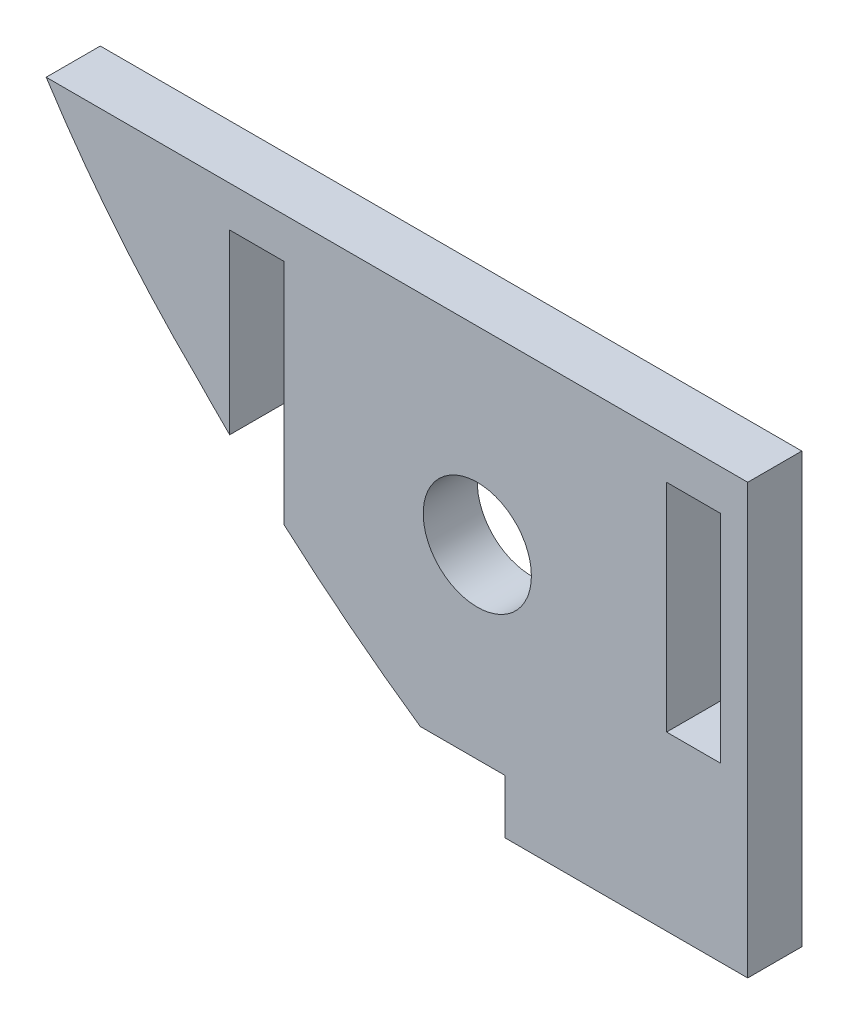
ISO-10303-21;
HEADER;
FILE_DESCRIPTION(('STEP AP214'),'2;1');
FILE_NAME('part.step','',(''),(''),'','','');
FILE_SCHEMA(('AUTOMOTIVE_DESIGN { 1 0 10303 214 1 1 1 1 }'));
ENDSEC;
DATA;
#1=APPLICATION_CONTEXT('core data for automotive mechanical design processes');
#2=APPLICATION_PROTOCOL_DEFINITION('international standard','automotive_design',2000,#1);
#3=PRODUCT_CONTEXT('',#1,'mechanical');
#4=PRODUCT('Part','Part','',(#3));
#5=PRODUCT_RELATED_PRODUCT_CATEGORY('part','',(#4));
#6=PRODUCT_DEFINITION_FORMATION('','',#4);
#7=PRODUCT_DEFINITION_CONTEXT('part definition',#1,'design');
#8=PRODUCT_DEFINITION('design','',#6,#7);
#9=PRODUCT_DEFINITION_SHAPE('','',#8);
#10=(LENGTH_UNIT() NAMED_UNIT(*) SI_UNIT(.MILLI.,.METRE.));
#11=(NAMED_UNIT(*) PLANE_ANGLE_UNIT() SI_UNIT($,.RADIAN.));
#12=(NAMED_UNIT(*) SI_UNIT($,.STERADIAN.) SOLID_ANGLE_UNIT());
#13=UNCERTAINTY_MEASURE_WITH_UNIT(LENGTH_MEASURE(1.E-05),#10,'distance_accuracy_value','');
#14=(GEOMETRIC_REPRESENTATION_CONTEXT(3) GLOBAL_UNCERTAINTY_ASSIGNED_CONTEXT((#13)) GLOBAL_UNIT_ASSIGNED_CONTEXT((#10,
#11,#12)) REPRESENTATION_CONTEXT('',''));
#15=CARTESIAN_POINT('',(0.,0.,0.));
#16=DIRECTION('',(0.,0.,1.));
#17=DIRECTION('',(1.,0.,0.));
#18=AXIS2_PLACEMENT_3D('',#15,#16,#17);
#19=CARTESIAN_POINT('',(8.86495465715672,23.9719209613924,2.));
#20=DIRECTION('',(0.,0.,1.));
#21=DIRECTION('',(1.,0.,0.));
#22=AXIS2_PLACEMENT_3D('',#19,#20,#21);
#23=PLANE('',#22);
#24=DIRECTION('',(0.,-1.,0.));
#25=VECTOR('',#24,1.);
#26=CARTESIAN_POINT('',(-0.675492065806116,-6.33042368116616,2.));
#27=LINE('',#26,#25);
#28=CARTESIAN_POINT('',(-0.675492065806116,1.66957631883384,2.));
#29=VERTEX_POINT('',#28);
#30=CARTESIAN_POINT('',(-0.675492065806116,-6.33042368116616,2.));
#31=VERTEX_POINT('',#30);
#32=EDGE_CURVE('E147',#29,#31,#27,.T.);
#33=ORIENTED_EDGE('',*,*,#32,.F.);
#34=DIRECTION('',(-1.,0.,0.));
#35=VECTOR('',#34,1.);
#36=CARTESIAN_POINT('',(-0.675492065806116,1.66957631883384,2.));
#37=LINE('',#36,#35);
#38=CARTESIAN_POINT('',(1.32450793419388,1.66957631883384,2.));
#39=VERTEX_POINT('',#38);
#40=EDGE_CURVE('E139',#39,#29,#37,.T.);
#41=ORIENTED_EDGE('',*,*,#40,.F.);
#42=DIRECTION('',(0.,1.,0.));
#43=VECTOR('',#42,1.);
#44=CARTESIAN_POINT('',(1.32450793419388,1.66957631883384,2.));
#45=LINE('',#44,#43);
#46=CARTESIAN_POINT('',(1.32450793419388,-6.33042368116616,2.));
#47=VERTEX_POINT('',#46);
#48=EDGE_CURVE('E162',#47,#39,#45,.T.);
#49=ORIENTED_EDGE('',*,*,#48,.F.);
#50=DIRECTION('',(1.,0.,0.));
#51=VECTOR('',#50,1.);
#52=CARTESIAN_POINT('',(1.32450793419388,-6.33042368116616,2.));
#53=LINE('',#52,#51);
#54=EDGE_CURVE('E160',#31,#47,#53,.T.);
#55=ORIENTED_EDGE('',*,*,#54,.F.);
#56=EDGE_LOOP('',(#33,#41,#49,#55));
#57=FACE_BOUND('',#56,.T.);
#58=DIRECTION('',(1.,0.,0.));
#59=VECTOR('',#58,1.);
#60=CARTESIAN_POINT('',(-6.6541329981665,-12.706050279369,2.));
#61=LINE('',#60,#59);
#62=CARTESIAN_POINT('',(-6.6541329981665,-12.706050279369,2.));
#63=VERTEX_POINT('',#62);
#64=CARTESIAN_POINT('',(2.32450793419389,-12.706050279369,2.));
#65=VERTEX_POINT('',#64);
#66=EDGE_CURVE('E178',#63,#65,#61,.T.);
#67=ORIENTED_EDGE('',*,*,#66,.T.);
#68=DIRECTION('',(0.,1.,0.));
#69=VECTOR('',#68,1.);
#70=CARTESIAN_POINT('',(2.32450793419389,3.16957631883384,2.));
#71=LINE('',#70,#69);
#72=CARTESIAN_POINT('',(2.32450793419389,3.16957631883384,2.));
#73=VERTEX_POINT('',#72);
#74=EDGE_CURVE('E181',#65,#73,#71,.T.);
#75=ORIENTED_EDGE('',*,*,#74,.T.);
#76=DIRECTION('',(-1.,0.,0.));
#77=VECTOR('',#76,1.);
#78=CARTESIAN_POINT('',(-23.6167131458751,3.16957631883382,2.));
#79=LINE('',#78,#77);
#80=CARTESIAN_POINT('',(-23.6167131458751,3.16957631883383,2.));
#81=VERTEX_POINT('',#80);
#82=EDGE_CURVE('E184',#73,#81,#79,.T.);
#83=ORIENTED_EDGE('',*,*,#82,.T.);
#84=CARTESIAN_POINT('',(8.86495465715672,23.9719209613924,2.));
#85=DIRECTION('',(0.,0.,1.));
#86=DIRECTION('',(1.,0.,0.));
#87=AXIS2_PLACEMENT_3D('',#84,#85,#86);
#88=CIRCLE('',#87,38.5719624325014);
#89=CARTESIAN_POINT('',(-17.9999999999967,-3.70605759852755,2.));
#90=VERTEX_POINT('',#89);
#91=EDGE_CURVE('E186',#81,#90,#88,.T.);
#92=ORIENTED_EDGE('',*,*,#91,.T.);
#93=CARTESIAN_POINT('',(20.320969023438,32.9517871888632,2.));
#94=DIRECTION('',(0.,0.,1.));
#95=DIRECTION('',(1.,0.,0.));
#96=AXIS2_PLACEMENT_3D('',#93,#94,#95);
#97=CIRCLE('',#96,53.0310687366517);
#98=CARTESIAN_POINT('',(-16.8318025278331,-4.88953701379299,2.));
#99=VERTEX_POINT('',#98);
#100=EDGE_CURVE('E188',#90,#99,#97,.T.);
#101=ORIENTED_EDGE('',*,*,#100,.T.);
#102=DIRECTION('',(0.,1.,0.));
#103=VECTOR('',#102,1.);
#104=CARTESIAN_POINT('',(-16.8318025278331,-4.88953701379299,2.));
#105=LINE('',#104,#103);
#106=CARTESIAN_POINT('',(-16.8318025278331,1.66957631883384,2.));
#107=VERTEX_POINT('',#106);
#108=EDGE_CURVE('E190',#99,#107,#105,.T.);
#109=ORIENTED_EDGE('',*,*,#108,.T.);
#110=DIRECTION('',(1.,0.,0.));
#111=VECTOR('',#110,1.);
#112=CARTESIAN_POINT('',(-16.8318025278331,1.66957631883384,2.));
#113=LINE('',#112,#111);
#114=CARTESIAN_POINT('',(-14.8318025278331,1.66957631883384,2.));
#115=VERTEX_POINT('',#114);
#116=EDGE_CURVE('E192',#107,#115,#113,.T.);
#117=ORIENTED_EDGE('',*,*,#116,.T.);
#118=DIRECTION('',(0.,-1.,0.));
#119=VECTOR('',#118,1.);
#120=CARTESIAN_POINT('',(-14.8318025278331,1.66957631883384,2.));
#121=LINE('',#120,#119);
#122=CARTESIAN_POINT('',(-14.8318025278331,-6.75434462494633,2.));
#123=VERTEX_POINT('',#122);
#124=EDGE_CURVE('E194',#115,#123,#121,.T.);
#125=ORIENTED_EDGE('',*,*,#124,.T.);
#126=CARTESIAN_POINT('',(20.320969023438,32.9517871888632,2.));
#127=DIRECTION('',(0.,0.,1.));
#128=DIRECTION('',(1.,0.,0.));
#129=AXIS2_PLACEMENT_3D('',#126,#127,#128);
#130=CIRCLE('',#129,53.0310687366517);
#131=CARTESIAN_POINT('',(-9.78363990856607,-10.706050279369,2.));
#132=VERTEX_POINT('',#131);
#133=EDGE_CURVE('E196',#123,#132,#130,.T.);
#134=ORIENTED_EDGE('',*,*,#133,.T.);
#135=DIRECTION('',(1.,0.,0.));
#136=VECTOR('',#135,1.);
#137=CARTESIAN_POINT('',(-9.78363990856607,-10.706050279369,2.));
#138=LINE('',#137,#136);
#139=CARTESIAN_POINT('',(-6.65413299816649,-10.706050279369,2.));
#140=VERTEX_POINT('',#139);
#141=EDGE_CURVE('E198',#132,#140,#138,.T.);
#142=ORIENTED_EDGE('',*,*,#141,.T.);
#143=DIRECTION('',(0.,-1.,0.));
#144=VECTOR('',#143,1.);
#145=CARTESIAN_POINT('',(-6.6541329981665,-12.706050279369,2.));
#146=LINE('',#145,#144);
#147=EDGE_CURVE('E200',#140,#63,#146,.T.);
#148=ORIENTED_EDGE('',*,*,#147,.T.);
#149=EDGE_LOOP('',(#67,#75,#83,#92,#101,#109,#117,#125,#134,#142,#148));
#150=FACE_BOUND('',#149,.T.);
#151=CARTESIAN_POINT('',(-7.67549206580617,-3.83042368116618,2.));
#152=DIRECTION('',(0.,0.,1.));
#153=DIRECTION('',(1.,0.,0.));
#154=AXIS2_PLACEMENT_3D('',#151,#152,#153);
#155=CIRCLE('',#154,2.);
#156=CARTESIAN_POINT('',(-5.67549206580618,-3.83042368116618,2.));
#157=VERTEX_POINT('',#156);
#158=EDGE_CURVE('E168',#157,#157,#155,.T.);
#159=ORIENTED_EDGE('',*,*,#158,.F.);
#160=EDGE_LOOP('',(#159));
#161=FACE_BOUND('',#160,.T.);
#162=ADVANCED_FACE('F32',(#57,#150,#161),#23,.T.);
#163=CARTESIAN_POINT('',(8.86495465715672,23.9719209613924,0.));
#164=DIRECTION('',(0.,0.,1.));
#165=DIRECTION('',(1.,0.,0.));
#166=AXIS2_PLACEMENT_3D('',#163,#164,#165);
#167=PLANE('',#166);
#168=DIRECTION('',(-1.,0.,0.));
#169=VECTOR('',#168,1.);
#170=CARTESIAN_POINT('',(-0.675492065806116,1.66957631883384,0.));
#171=LINE('',#170,#169);
#172=CARTESIAN_POINT('',(1.32450793419388,1.66957631883384,0.));
#173=VERTEX_POINT('',#172);
#174=CARTESIAN_POINT('',(-0.675492065806116,1.66957631883384,0.));
#175=VERTEX_POINT('',#174);
#176=EDGE_CURVE('E55',#173,#175,#171,.T.);
#177=ORIENTED_EDGE('',*,*,#176,.T.);
#178=DIRECTION('',(0.,-1.,0.));
#179=VECTOR('',#178,1.);
#180=CARTESIAN_POINT('',(-0.675492065806116,-6.33042368116616,0.));
#181=LINE('',#180,#179);
#182=CARTESIAN_POINT('',(-0.675492065806116,-6.33042368116616,0.));
#183=VERTEX_POINT('',#182);
#184=EDGE_CURVE('E154',#175,#183,#181,.T.);
#185=ORIENTED_EDGE('',*,*,#184,.T.);
#186=DIRECTION('',(1.,0.,0.));
#187=VECTOR('',#186,1.);
#188=CARTESIAN_POINT('',(1.32450793419388,-6.33042368116616,0.));
#189=LINE('',#188,#187);
#190=CARTESIAN_POINT('',(1.32450793419388,-6.33042368116616,0.));
#191=VERTEX_POINT('',#190);
#192=EDGE_CURVE('E170',#183,#191,#189,.T.);
#193=ORIENTED_EDGE('',*,*,#192,.T.);
#194=DIRECTION('',(0.,1.,0.));
#195=VECTOR('',#194,1.);
#196=CARTESIAN_POINT('',(1.32450793419388,1.66957631883384,0.));
#197=LINE('',#196,#195);
#198=EDGE_CURVE('E148',#191,#173,#197,.T.);
#199=ORIENTED_EDGE('',*,*,#198,.T.);
#200=EDGE_LOOP('',(#177,#185,#193,#199));
#201=FACE_BOUND('',#200,.T.);
#202=DIRECTION('',(1.,0.,0.));
#203=VECTOR('',#202,1.);
#204=CARTESIAN_POINT('',(-6.6541329981665,-12.706050279369,0.));
#205=LINE('',#204,#203);
#206=CARTESIAN_POINT('',(-6.6541329981665,-12.706050279369,0.));
#207=VERTEX_POINT('',#206);
#208=CARTESIAN_POINT('',(2.32450793419389,-12.706050279369,0.));
#209=VERTEX_POINT('',#208);
#210=EDGE_CURVE('E155',#207,#209,#205,.T.);
#211=ORIENTED_EDGE('',*,*,#210,.F.);
#212=DIRECTION('',(0.,-1.,0.));
#213=VECTOR('',#212,1.);
#214=CARTESIAN_POINT('',(-6.6541329981665,-12.706050279369,0.));
#215=LINE('',#214,#213);
#216=CARTESIAN_POINT('',(-6.65413299816649,-10.706050279369,0.));
#217=VERTEX_POINT('',#216);
#218=EDGE_CURVE('E182',#217,#207,#215,.T.);
#219=ORIENTED_EDGE('',*,*,#218,.F.);
#220=DIRECTION('',(1.,0.,0.));
#221=VECTOR('',#220,1.);
#222=CARTESIAN_POINT('',(-9.78363990856607,-10.706050279369,0.));
#223=LINE('',#222,#221);
#224=CARTESIAN_POINT('',(-9.78363990856607,-10.706050279369,0.));
#225=VERTEX_POINT('',#224);
#226=EDGE_CURVE('E221',#225,#217,#223,.T.);
#227=ORIENTED_EDGE('',*,*,#226,.F.);
#228=CARTESIAN_POINT('',(20.320969023438,32.9517871888632,0.));
#229=DIRECTION('',(0.,0.,1.));
#230=DIRECTION('',(1.,0.,0.));
#231=AXIS2_PLACEMENT_3D('',#228,#229,#230);
#232=CIRCLE('',#231,53.0310687366517);
#233=CARTESIAN_POINT('',(-14.8318025278331,-6.75434462494633,0.));
#234=VERTEX_POINT('',#233);
#235=EDGE_CURVE('E219',#234,#225,#232,.T.);
#236=ORIENTED_EDGE('',*,*,#235,.F.);
#237=DIRECTION('',(0.,-1.,0.));
#238=VECTOR('',#237,1.);
#239=CARTESIAN_POINT('',(-14.8318025278331,1.66957631883384,0.));
#240=LINE('',#239,#238);
#241=CARTESIAN_POINT('',(-14.8318025278331,1.66957631883384,0.));
#242=VERTEX_POINT('',#241);
#243=EDGE_CURVE('E217',#242,#234,#240,.T.);
#244=ORIENTED_EDGE('',*,*,#243,.F.);
#245=DIRECTION('',(1.,0.,0.));
#246=VECTOR('',#245,1.);
#247=CARTESIAN_POINT('',(-16.8318025278331,1.66957631883384,0.));
#248=LINE('',#247,#246);
#249=CARTESIAN_POINT('',(-16.8318025278331,1.66957631883384,0.));
#250=VERTEX_POINT('',#249);
#251=EDGE_CURVE('E215',#250,#242,#248,.T.);
#252=ORIENTED_EDGE('',*,*,#251,.F.);
#253=DIRECTION('',(0.,1.,0.));
#254=VECTOR('',#253,1.);
#255=CARTESIAN_POINT('',(-16.8318025278331,-4.88953701379299,0.));
#256=LINE('',#255,#254);
#257=CARTESIAN_POINT('',(-16.8318025278331,-4.88953701379299,0.));
#258=VERTEX_POINT('',#257);
#259=EDGE_CURVE('E213',#258,#250,#256,.T.);
#260=ORIENTED_EDGE('',*,*,#259,.F.);
#261=CARTESIAN_POINT('',(20.320969023438,32.9517871888632,0.));
#262=DIRECTION('',(0.,0.,1.));
#263=DIRECTION('',(1.,0.,0.));
#264=AXIS2_PLACEMENT_3D('',#261,#262,#263);
#265=CIRCLE('',#264,53.0310687366517);
#266=CARTESIAN_POINT('',(-17.9999999999967,-3.70605759852755,0.));
#267=VERTEX_POINT('',#266);
#268=EDGE_CURVE('E211',#267,#258,#265,.T.);
#269=ORIENTED_EDGE('',*,*,#268,.F.);
#270=CARTESIAN_POINT('',(8.86495465715672,23.9719209613924,0.));
#271=DIRECTION('',(0.,0.,1.));
#272=DIRECTION('',(1.,0.,0.));
#273=AXIS2_PLACEMENT_3D('',#270,#271,#272);
#274=CIRCLE('',#273,38.5719624325014);
#275=CARTESIAN_POINT('',(-23.6167131458751,3.16957631883383,0.));
#276=VERTEX_POINT('',#275);
#277=EDGE_CURVE('E209',#276,#267,#274,.T.);
#278=ORIENTED_EDGE('',*,*,#277,.F.);
#279=DIRECTION('',(-1.,0.,0.));
#280=VECTOR('',#279,1.);
#281=CARTESIAN_POINT('',(-23.6167131458751,3.16957631883382,0.));
#282=LINE('',#281,#280);
#283=CARTESIAN_POINT('',(2.32450793419389,3.16957631883384,0.));
#284=VERTEX_POINT('',#283);
#285=EDGE_CURVE('E207',#284,#276,#282,.T.);
#286=ORIENTED_EDGE('',*,*,#285,.F.);
#287=DIRECTION('',(0.,1.,0.));
#288=VECTOR('',#287,1.);
#289=CARTESIAN_POINT('',(2.32450793419389,3.16957631883384,0.));
#290=LINE('',#289,#288);
#291=EDGE_CURVE('E205',#209,#284,#290,.T.);
#292=ORIENTED_EDGE('',*,*,#291,.F.);
#293=EDGE_LOOP('',(#211,#219,#227,#236,#244,#252,#260,#269,#278,#286,#292));
#294=FACE_BOUND('',#293,.T.);
#295=CARTESIAN_POINT('',(-7.67549206580617,-3.83042368116618,0.));
#296=DIRECTION('',(0.,0.,1.));
#297=DIRECTION('',(1.,0.,0.));
#298=AXIS2_PLACEMENT_3D('',#295,#296,#297);
#299=CIRCLE('',#298,2.);
#300=CARTESIAN_POINT('',(-5.67549206580618,-3.83042368116618,0.));
#301=VERTEX_POINT('',#300);
#302=EDGE_CURVE('E465',#301,#301,#299,.T.);
#303=ORIENTED_EDGE('',*,*,#302,.T.);
#304=EDGE_LOOP('',(#303));
#305=FACE_BOUND('',#304,.T.);
#306=ADVANCED_FACE('F260',(#201,#294,#305),#167,.F.);
#307=CARTESIAN_POINT('',(-6.6541329981665,-12.706050279369,2.));
#308=DIRECTION('',(0.,1.,0.));
#309=DIRECTION('',(-1.,0.,0.));
#310=AXIS2_PLACEMENT_3D('',#307,#308,#309);
#311=PLANE('',#310);
#312=ORIENTED_EDGE('',*,*,#210,.T.);
#313=DIRECTION('',(0.,0.,-1.));
#314=VECTOR('',#313,1.);
#315=CARTESIAN_POINT('',(2.32450793419389,-12.706050279369,2.));
#316=LINE('',#315,#314);
#317=EDGE_CURVE('E11',#65,#209,#316,.T.);
#318=ORIENTED_EDGE('',*,*,#317,.F.);
#319=ORIENTED_EDGE('',*,*,#66,.F.);
#320=DIRECTION('',(0.,0.,-1.));
#321=VECTOR('',#320,1.);
#322=CARTESIAN_POINT('',(-6.6541329981665,-12.706050279369,2.));
#323=LINE('',#322,#321);
#324=EDGE_CURVE('E202',#63,#207,#323,.T.);
#325=ORIENTED_EDGE('',*,*,#324,.T.);
#326=EDGE_LOOP('',(#312,#318,#319,#325));
#327=FACE_BOUND('',#326,.T.);
#328=ADVANCED_FACE('F34',(#327),#311,.F.);
#329=CARTESIAN_POINT('',(2.32450793419389,3.16957631883384,2.));
#330=DIRECTION('',(-1.,0.,0.));
#331=DIRECTION('',(0.,0.,1.));
#332=AXIS2_PLACEMENT_3D('',#329,#330,#331);
#333=PLANE('',#332);
#334=ORIENTED_EDGE('',*,*,#291,.T.);
#335=DIRECTION('',(0.,0.,-1.));
#336=VECTOR('',#335,1.);
#337=CARTESIAN_POINT('',(2.32450793419389,3.16957631883384,2.));
#338=LINE('',#337,#336);
#339=EDGE_CURVE('E40',#73,#284,#338,.T.);
#340=ORIENTED_EDGE('',*,*,#339,.F.);
#341=ORIENTED_EDGE('',*,*,#74,.F.);
#342=ORIENTED_EDGE('',*,*,#317,.T.);
#343=EDGE_LOOP('',(#334,#340,#341,#342));
#344=FACE_BOUND('',#343,.T.);
#345=ADVANCED_FACE('F277',(#344),#333,.F.);
#346=CARTESIAN_POINT('',(-23.6167131458751,3.16957631883382,2.));
#347=DIRECTION('',(0.,-1.,0.));
#348=DIRECTION('',(1.,0.,0.));
#349=AXIS2_PLACEMENT_3D('',#346,#347,#348);
#350=PLANE('',#349);
#351=ORIENTED_EDGE('',*,*,#285,.T.);
#352=DIRECTION('',(0.,0.,-1.));
#353=VECTOR('',#352,1.);
#354=CARTESIAN_POINT('',(-23.6167131458751,3.16957631883383,2.));
#355=LINE('',#354,#353);
#356=EDGE_CURVE('E247',#81,#276,#355,.T.);
#357=ORIENTED_EDGE('',*,*,#356,.F.);
#358=ORIENTED_EDGE('',*,*,#82,.F.);
#359=ORIENTED_EDGE('',*,*,#339,.T.);
#360=EDGE_LOOP('',(#351,#357,#358,#359));
#361=FACE_BOUND('',#360,.T.);
#362=ADVANCED_FACE('F254',(#361),#350,.F.);
#363=CARTESIAN_POINT('',(8.86495465715672,23.9719209613924,2.));
#364=DIRECTION('',(0.,0.,-1.));
#365=DIRECTION('',(-1.,0.,0.));
#366=AXIS2_PLACEMENT_3D('',#363,#364,#365);
#367=CYLINDRICAL_SURFACE('',#366,38.5719624325014);
#368=ORIENTED_EDGE('',*,*,#277,.T.);
#369=DIRECTION('',(0.,0.,-1.));
#370=VECTOR('',#369,1.);
#371=CARTESIAN_POINT('',(-17.9999999999967,-3.70605759852755,2.));
#372=LINE('',#371,#370);
#373=EDGE_CURVE('E244',#90,#267,#372,.T.);
#374=ORIENTED_EDGE('',*,*,#373,.F.);
#375=ORIENTED_EDGE('',*,*,#91,.F.);
#376=ORIENTED_EDGE('',*,*,#356,.T.);
#377=EDGE_LOOP('',(#368,#374,#375,#376));
#378=FACE_BOUND('',#377,.T.);
#379=ADVANCED_FACE('F266',(#378),#367,.T.);
#380=CARTESIAN_POINT('',(20.320969023438,32.9517871888632,2.));
#381=DIRECTION('',(0.,0.,-1.));
#382=DIRECTION('',(-1.,0.,0.));
#383=AXIS2_PLACEMENT_3D('',#380,#381,#382);
#384=CYLINDRICAL_SURFACE('',#383,53.0310687366517);
#385=ORIENTED_EDGE('',*,*,#268,.T.);
#386=DIRECTION('',(0.,0.,-1.));
#387=VECTOR('',#386,1.);
#388=CARTESIAN_POINT('',(-16.8318025278331,-4.88953701379299,2.));
#389=LINE('',#388,#387);
#390=EDGE_CURVE('E241',#99,#258,#389,.T.);
#391=ORIENTED_EDGE('',*,*,#390,.F.);
#392=ORIENTED_EDGE('',*,*,#100,.F.);
#393=ORIENTED_EDGE('',*,*,#373,.T.);
#394=EDGE_LOOP('',(#385,#391,#392,#393));
#395=FACE_BOUND('',#394,.T.);
#396=ADVANCED_FACE('F270',(#395),#384,.T.);
#397=CARTESIAN_POINT('',(-16.8318025278331,-4.88953701379299,2.));
#398=DIRECTION('',(-1.,0.,0.));
#399=DIRECTION('',(0.,0.,1.));
#400=AXIS2_PLACEMENT_3D('',#397,#398,#399);
#401=PLANE('',#400);
#402=ORIENTED_EDGE('',*,*,#259,.T.);
#403=DIRECTION('',(0.,0.,-1.));
#404=VECTOR('',#403,1.);
#405=CARTESIAN_POINT('',(-16.8318025278331,1.66957631883384,2.));
#406=LINE('',#405,#404);
#407=EDGE_CURVE('E238',#107,#250,#406,.T.);
#408=ORIENTED_EDGE('',*,*,#407,.F.);
#409=ORIENTED_EDGE('',*,*,#108,.F.);
#410=ORIENTED_EDGE('',*,*,#390,.T.);
#411=EDGE_LOOP('',(#402,#408,#409,#410));
#412=FACE_BOUND('',#411,.T.);
#413=ADVANCED_FACE('F305',(#412),#401,.F.);
#414=CARTESIAN_POINT('',(-16.8318025278331,1.66957631883384,2.));
#415=DIRECTION('',(0.,1.,0.));
#416=DIRECTION('',(0.,0.,1.));
#417=AXIS2_PLACEMENT_3D('',#414,#415,#416);
#418=PLANE('',#417);
#419=ORIENTED_EDGE('',*,*,#251,.T.);
#420=DIRECTION('',(0.,0.,-1.));
#421=VECTOR('',#420,1.);
#422=CARTESIAN_POINT('',(-14.8318025278331,1.66957631883384,2.));
#423=LINE('',#422,#421);
#424=EDGE_CURVE('E235',#115,#242,#423,.T.);
#425=ORIENTED_EDGE('',*,*,#424,.F.);
#426=ORIENTED_EDGE('',*,*,#116,.F.);
#427=ORIENTED_EDGE('',*,*,#407,.T.);
#428=EDGE_LOOP('',(#419,#425,#426,#427));
#429=FACE_BOUND('',#428,.T.);
#430=ADVANCED_FACE('F303',(#429),#418,.F.);
#431=CARTESIAN_POINT('',(-14.8318025278331,1.66957631883384,2.));
#432=DIRECTION('',(1.,0.,0.));
#433=DIRECTION('',(0.,1.,0.));
#434=AXIS2_PLACEMENT_3D('',#431,#432,#433);
#435=PLANE('',#434);
#436=ORIENTED_EDGE('',*,*,#243,.T.);
#437=DIRECTION('',(0.,0.,-1.));
#438=VECTOR('',#437,1.);
#439=CARTESIAN_POINT('',(-14.8318025278331,-6.75434462494633,2.));
#440=LINE('',#439,#438);
#441=EDGE_CURVE('E232',#123,#234,#440,.T.);
#442=ORIENTED_EDGE('',*,*,#441,.F.);
#443=ORIENTED_EDGE('',*,*,#124,.F.);
#444=ORIENTED_EDGE('',*,*,#424,.T.);
#445=EDGE_LOOP('',(#436,#442,#443,#444));
#446=FACE_BOUND('',#445,.T.);
#447=ADVANCED_FACE('F298',(#446),#435,.F.);
#448=CARTESIAN_POINT('',(20.320969023438,32.9517871888632,2.));
#449=DIRECTION('',(0.,0.,-1.));
#450=DIRECTION('',(-1.,0.,0.));
#451=AXIS2_PLACEMENT_3D('',#448,#449,#450);
#452=CYLINDRICAL_SURFACE('',#451,53.0310687366517);
#453=ORIENTED_EDGE('',*,*,#235,.T.);
#454=DIRECTION('',(0.,0.,-1.));
#455=VECTOR('',#454,1.);
#456=CARTESIAN_POINT('',(-9.78363990856607,-10.706050279369,2.));
#457=LINE('',#456,#455);
#458=EDGE_CURVE('E229',#132,#225,#457,.T.);
#459=ORIENTED_EDGE('',*,*,#458,.F.);
#460=ORIENTED_EDGE('',*,*,#133,.F.);
#461=ORIENTED_EDGE('',*,*,#441,.T.);
#462=EDGE_LOOP('',(#453,#459,#460,#461));
#463=FACE_BOUND('',#462,.T.);
#464=ADVANCED_FACE('F293',(#463),#452,.T.);
#465=CARTESIAN_POINT('',(-9.78363990856607,-10.706050279369,2.));
#466=DIRECTION('',(0.,1.,0.));
#467=DIRECTION('',(-1.,0.,0.));
#468=AXIS2_PLACEMENT_3D('',#465,#466,#467);
#469=PLANE('',#468);
#470=ORIENTED_EDGE('',*,*,#226,.T.);
#471=DIRECTION('',(0.,0.,-1.));
#472=VECTOR('',#471,1.);
#473=CARTESIAN_POINT('',(-6.65413299816649,-10.706050279369,2.));
#474=LINE('',#473,#472);
#475=EDGE_CURVE('E226',#140,#217,#474,.T.);
#476=ORIENTED_EDGE('',*,*,#475,.F.);
#477=ORIENTED_EDGE('',*,*,#141,.F.);
#478=ORIENTED_EDGE('',*,*,#458,.T.);
#479=EDGE_LOOP('',(#470,#476,#477,#478));
#480=FACE_BOUND('',#479,.T.);
#481=ADVANCED_FACE('F289',(#480),#469,.F.);
#482=CARTESIAN_POINT('',(-6.6541329981665,-12.706050279369,2.));
#483=DIRECTION('',(1.,0.,0.));
#484=DIRECTION('',(0.,1.,0.));
#485=AXIS2_PLACEMENT_3D('',#482,#483,#484);
#486=PLANE('',#485);
#487=ORIENTED_EDGE('',*,*,#218,.T.);
#488=ORIENTED_EDGE('',*,*,#324,.F.);
#489=ORIENTED_EDGE('',*,*,#147,.F.);
#490=ORIENTED_EDGE('',*,*,#475,.T.);
#491=EDGE_LOOP('',(#487,#488,#489,#490));
#492=FACE_BOUND('',#491,.T.);
#493=ADVANCED_FACE('F284',(#492),#486,.F.);
#494=CARTESIAN_POINT('',(-0.675492065806116,1.66957631883384,2.));
#495=DIRECTION('',(0.,-1.,0.));
#496=DIRECTION('',(1.,0.,0.));
#497=AXIS2_PLACEMENT_3D('',#494,#495,#496);
#498=PLANE('',#497);
#499=ORIENTED_EDGE('',*,*,#176,.F.);
#500=DIRECTION('',(0.,0.,-1.));
#501=VECTOR('',#500,1.);
#502=CARTESIAN_POINT('',(1.32450793419388,1.66957631883384,2.));
#503=LINE('',#502,#501);
#504=EDGE_CURVE('E143',#39,#173,#503,.T.);
#505=ORIENTED_EDGE('',*,*,#504,.F.);
#506=ORIENTED_EDGE('',*,*,#40,.T.);
#507=DIRECTION('',(0.,0.,-1.));
#508=VECTOR('',#507,1.);
#509=CARTESIAN_POINT('',(-0.675492065806116,1.66957631883384,2.));
#510=LINE('',#509,#508);
#511=EDGE_CURVE('E142',#29,#175,#510,.T.);
#512=ORIENTED_EDGE('',*,*,#511,.T.);
#513=EDGE_LOOP('',(#499,#505,#506,#512));
#514=FACE_BOUND('',#513,.T.);
#515=ADVANCED_FACE('F141',(#514),#498,.T.);
#516=CARTESIAN_POINT('',(-0.675492065806116,-6.33042368116616,2.));
#517=DIRECTION('',(1.,0.,0.));
#518=DIRECTION('',(0.,0.,-1.));
#519=AXIS2_PLACEMENT_3D('',#516,#517,#518);
#520=PLANE('',#519);
#521=ORIENTED_EDGE('',*,*,#184,.F.);
#522=ORIENTED_EDGE('',*,*,#511,.F.);
#523=ORIENTED_EDGE('',*,*,#32,.T.);
#524=DIRECTION('',(0.,0.,-1.));
#525=VECTOR('',#524,1.);
#526=CARTESIAN_POINT('',(-0.675492065806116,-6.33042368116616,2.));
#527=LINE('',#526,#525);
#528=EDGE_CURVE('E156',#31,#183,#527,.T.);
#529=ORIENTED_EDGE('',*,*,#528,.T.);
#530=EDGE_LOOP('',(#521,#522,#523,#529));
#531=FACE_BOUND('',#530,.T.);
#532=ADVANCED_FACE('F151',(#531),#520,.T.);
#533=CARTESIAN_POINT('',(1.32450793419388,-6.33042368116616,2.));
#534=DIRECTION('',(0.,1.,0.));
#535=DIRECTION('',(-1.,0.,0.));
#536=AXIS2_PLACEMENT_3D('',#533,#534,#535);
#537=PLANE('',#536);
#538=ORIENTED_EDGE('',*,*,#192,.F.);
#539=ORIENTED_EDGE('',*,*,#528,.F.);
#540=ORIENTED_EDGE('',*,*,#54,.T.);
#541=DIRECTION('',(0.,0.,-1.));
#542=VECTOR('',#541,1.);
#543=CARTESIAN_POINT('',(1.32450793419388,-6.33042368116616,2.));
#544=LINE('',#543,#542);
#545=EDGE_CURVE('E47',#47,#191,#544,.T.);
#546=ORIENTED_EDGE('',*,*,#545,.T.);
#547=EDGE_LOOP('',(#538,#539,#540,#546));
#548=FACE_BOUND('',#547,.T.);
#549=ADVANCED_FACE('F358',(#548),#537,.T.);
#550=CARTESIAN_POINT('',(1.32450793419388,1.66957631883384,2.));
#551=DIRECTION('',(-1.,0.,0.));
#552=DIRECTION('',(0.,-1.,0.));
#553=AXIS2_PLACEMENT_3D('',#550,#551,#552);
#554=PLANE('',#553);
#555=ORIENTED_EDGE('',*,*,#198,.F.);
#556=ORIENTED_EDGE('',*,*,#545,.F.);
#557=ORIENTED_EDGE('',*,*,#48,.T.);
#558=ORIENTED_EDGE('',*,*,#504,.T.);
#559=EDGE_LOOP('',(#555,#556,#557,#558));
#560=FACE_BOUND('',#559,.T.);
#561=ADVANCED_FACE('F364',(#560),#554,.T.);
#562=CARTESIAN_POINT('',(-7.67549206580617,-3.83042368116618,2.));
#563=DIRECTION('',(0.,0.,-1.));
#564=DIRECTION('',(-1.,0.,0.));
#565=AXIS2_PLACEMENT_3D('',#562,#563,#564);
#566=CYLINDRICAL_SURFACE('',#565,2.);
#567=ORIENTED_EDGE('',*,*,#158,.T.);
#568=EDGE_LOOP('',(#567));
#569=FACE_BOUND('',#568,.T.);
#570=ORIENTED_EDGE('',*,*,#302,.F.);
#571=EDGE_LOOP('',(#570));
#572=FACE_BOUND('',#571,.T.);
#573=ADVANCED_FACE('F372',(#569,#572),#566,.F.);
#574=CLOSED_SHELL('',(#162,#306,#328,#345,#362,#379,#396,#413,#430,#447,#464,#481,#493,#515,
#532,#549,#561,#573));
#575=MANIFOLD_SOLID_BREP('B2',#574);
#576=ADVANCED_BREP_SHAPE_REPRESENTATION('',(#18,#575),#14);
#577=SHAPE_DEFINITION_REPRESENTATION(#9,#576);
ENDSEC;
END-ISO-10303-21;
